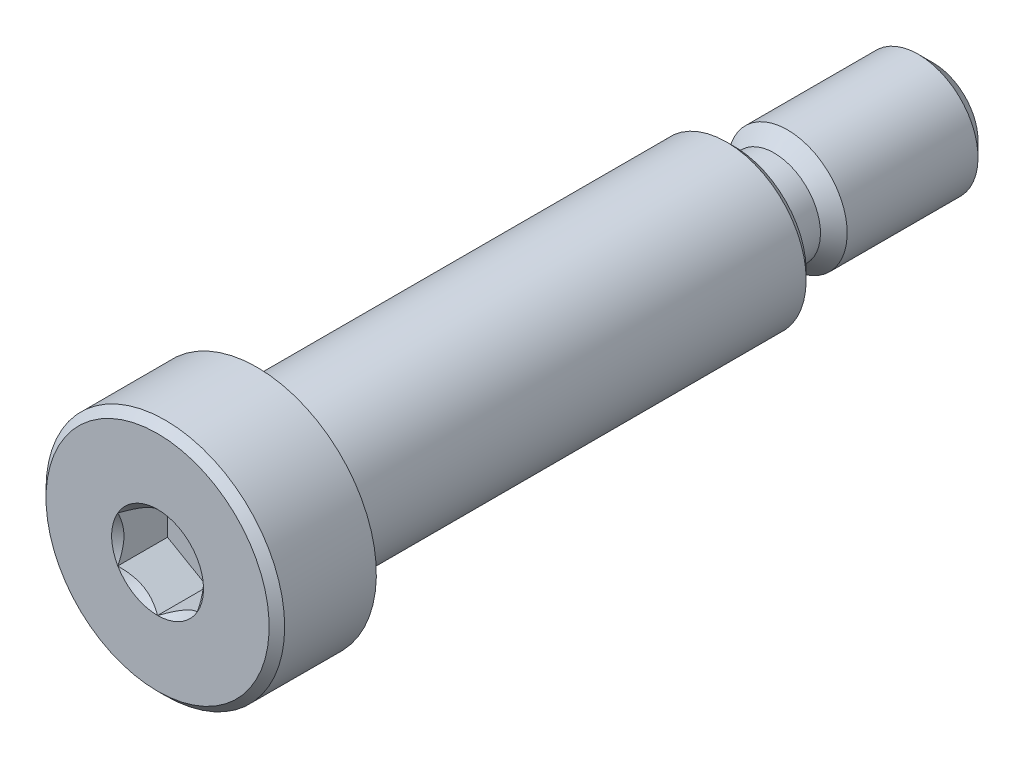
ISO-10303-21;
HEADER;
FILE_DESCRIPTION(('STEP AP214'),'2;1');
FILE_NAME('part.step','',(''),(''),'','','');
FILE_SCHEMA(('AUTOMOTIVE_DESIGN { 1 0 10303 214 1 1 1 1 }'));
ENDSEC;
DATA;
#1=APPLICATION_CONTEXT('core data for automotive mechanical design processes');
#2=APPLICATION_PROTOCOL_DEFINITION('international standard','automotive_design',2000,#1);
#3=PRODUCT_CONTEXT('',#1,'mechanical');
#4=PRODUCT('Part','Part','',(#3));
#5=PRODUCT_RELATED_PRODUCT_CATEGORY('part','',(#4));
#6=PRODUCT_DEFINITION_FORMATION('','',#4);
#7=PRODUCT_DEFINITION_CONTEXT('part definition',#1,'design');
#8=PRODUCT_DEFINITION('design','',#6,#7);
#9=PRODUCT_DEFINITION_SHAPE('','',#8);
#10=(LENGTH_UNIT() NAMED_UNIT(*) SI_UNIT(.MILLI.,.METRE.));
#11=(NAMED_UNIT(*) PLANE_ANGLE_UNIT() SI_UNIT($,.RADIAN.));
#12=(NAMED_UNIT(*) SI_UNIT($,.STERADIAN.) SOLID_ANGLE_UNIT());
#13=UNCERTAINTY_MEASURE_WITH_UNIT(LENGTH_MEASURE(1.E-05),#10,'distance_accuracy_value','');
#14=(GEOMETRIC_REPRESENTATION_CONTEXT(3) GLOBAL_UNCERTAINTY_ASSIGNED_CONTEXT((#13)) GLOBAL_UNIT_ASSIGNED_CONTEXT((#10,
#11,#12)) REPRESENTATION_CONTEXT('',''));
#15=CARTESIAN_POINT('',(0.,0.,0.));
#16=DIRECTION('',(0.,0.,1.));
#17=DIRECTION('',(1.,0.,0.));
#18=AXIS2_PLACEMENT_3D('',#15,#16,#17);
#19=CARTESIAN_POINT('',(0.,0.,0.));
#20=DIRECTION('',(0.,0.,1.));
#21=DIRECTION('',(0.,-1.,0.));
#22=AXIS2_PLACEMENT_3D('',#19,#20,#21);
#23=PLANE('',#22);
#24=CARTESIAN_POINT('',(0.,0.,0.));
#25=DIRECTION('',(0.,0.,1.));
#26=DIRECTION('',(1.,0.,0.));
#27=AXIS2_PLACEMENT_3D('',#24,#25,#26);
#28=CIRCLE('',#27,3.66617420935412);
#29=CARTESIAN_POINT('',(0.,-3.66617420935412,0.));
#30=VERTEX_POINT('',#29);
#31=CARTESIAN_POINT('',(3.175,-1.83308710467707,0.));
#32=VERTEX_POINT('',#31);
#33=EDGE_CURVE('E58',#30,#32,#28,.T.);
#34=ORIENTED_EDGE('',*,*,#33,.F.);
#35=CARTESIAN_POINT('',(-3.175,-1.83308710467706,0.));
#36=VERTEX_POINT('',#35);
#37=EDGE_CURVE('E65',#36,#30,#28,.T.);
#38=ORIENTED_EDGE('',*,*,#37,.F.);
#39=CARTESIAN_POINT('',(-3.175,1.83308710467706,0.));
#40=VERTEX_POINT('',#39);
#41=EDGE_CURVE('E138',#40,#36,#28,.T.);
#42=ORIENTED_EDGE('',*,*,#41,.F.);
#43=CARTESIAN_POINT('',(0.,3.66617420935412,0.));
#44=VERTEX_POINT('',#43);
#45=EDGE_CURVE('E133',#44,#40,#28,.T.);
#46=ORIENTED_EDGE('',*,*,#45,.F.);
#47=CARTESIAN_POINT('',(3.175,1.83308710467706,0.));
#48=VERTEX_POINT('',#47);
#49=EDGE_CURVE('E106',#48,#44,#28,.T.);
#50=ORIENTED_EDGE('',*,*,#49,.F.);
#51=EDGE_CURVE('E97',#32,#48,#28,.T.);
#52=ORIENTED_EDGE('',*,*,#51,.F.);
#53=EDGE_LOOP('',(#34,#38,#42,#46,#50,#52));
#54=FACE_BOUND('',#53,.T.);
#55=CARTESIAN_POINT('',(0.,0.,0.));
#56=DIRECTION('',(0.,0.,1.));
#57=DIRECTION('',(0.,-1.,0.));
#58=AXIS2_PLACEMENT_3D('',#55,#56,#57);
#59=CIRCLE('',#58,8.90587499999999);
#60=CARTESIAN_POINT('',(0.,-8.90587499999999,0.));
#61=VERTEX_POINT('',#60);
#62=EDGE_CURVE('E52',#61,#61,#59,.T.);
#63=ORIENTED_EDGE('',*,*,#62,.T.);
#64=EDGE_LOOP('',(#63));
#65=FACE_BOUND('',#64,.T.);
#66=ADVANCED_FACE('F38',(#54,#65),#23,.T.);
#67=CARTESIAN_POINT('',(0.,0.,-61.9125));
#68=DIRECTION('',(0.,0.,-1.));
#69=DIRECTION('',(0.,1.,0.));
#70=AXIS2_PLACEMENT_3D('',#67,#68,#69);
#71=CYLINDRICAL_SURFACE('',#70,9.525);
#72=CARTESIAN_POINT('',(0.,0.,-0.619125000000019));
#73=DIRECTION('',(0.,0.,1.));
#74=DIRECTION('',(0.,-1.,0.));
#75=AXIS2_PLACEMENT_3D('',#72,#73,#74);
#76=CIRCLE('',#75,9.525);
#77=CARTESIAN_POINT('',(0.,-9.525,-0.619125000000019));
#78=VERTEX_POINT('',#77);
#79=EDGE_CURVE('E230',#78,#78,#76,.F.);
#80=ORIENTED_EDGE('',*,*,#79,.T.);
#81=EDGE_LOOP('',(#80));
#82=FACE_BOUND('',#81,.T.);
#83=CARTESIAN_POINT('',(0.,0.,-7.93750000000001));
#84=DIRECTION('',(0.,0.,-1.));
#85=DIRECTION('',(0.,1.,0.));
#86=AXIS2_PLACEMENT_3D('',#83,#84,#85);
#87=CIRCLE('',#86,9.525);
#88=CARTESIAN_POINT('',(0.,9.525,-7.93750000000001));
#89=VERTEX_POINT('',#88);
#90=EDGE_CURVE('E245',#89,#89,#87,.T.);
#91=ORIENTED_EDGE('',*,*,#90,.F.);
#92=EDGE_LOOP('',(#91));
#93=FACE_BOUND('',#92,.T.);
#94=ADVANCED_FACE('F199',(#82,#93),#71,.T.);
#95=CARTESIAN_POINT('',(0.,-9.525,-7.93750000000001));
#96=DIRECTION('',(0.,0.,-1.));
#97=DIRECTION('',(0.,1.,0.));
#98=AXIS2_PLACEMENT_3D('',#95,#96,#97);
#99=PLANE('',#98);
#100=ORIENTED_EDGE('',*,*,#90,.T.);
#101=EDGE_LOOP('',(#100));
#102=FACE_BOUND('',#101,.T.);
#103=CARTESIAN_POINT('',(0.,0.,-7.93750000000001));
#104=DIRECTION('',(0.,0.,-1.));
#105=DIRECTION('',(0.,1.,0.));
#106=AXIS2_PLACEMENT_3D('',#103,#104,#105);
#107=CIRCLE('',#106,6.34999999999999);
#108=CARTESIAN_POINT('',(0.,6.34999999999999,-7.93750000000001));
#109=VERTEX_POINT('',#108);
#110=EDGE_CURVE('E247',#109,#109,#107,.T.);
#111=ORIENTED_EDGE('',*,*,#110,.F.);
#112=EDGE_LOOP('',(#111));
#113=FACE_BOUND('',#112,.T.);
#114=ADVANCED_FACE('F204',(#102,#113),#99,.T.);
#115=CARTESIAN_POINT('',(0.,0.,-61.9125));
#116=DIRECTION('',(0.,0.,-1.));
#117=DIRECTION('',(0.,1.,0.));
#118=AXIS2_PLACEMENT_3D('',#115,#116,#117);
#119=CYLINDRICAL_SURFACE('',#118,6.35);
#120=CARTESIAN_POINT('',(0.,0.,-45.418375));
#121=DIRECTION('',(0.,0.,-1.));
#122=DIRECTION('',(0.,1.,0.));
#123=AXIS2_PLACEMENT_3D('',#120,#121,#122);
#124=CIRCLE('',#123,6.35);
#125=CARTESIAN_POINT('',(0.,-6.34999999999999,-45.418375));
#126=VERTEX_POINT('',#125);
#127=EDGE_CURVE('E223',#126,#126,#124,.F.);
#128=ORIENTED_EDGE('',*,*,#127,.T.);
#129=EDGE_LOOP('',(#128));
#130=FACE_BOUND('',#129,.T.);
#131=ORIENTED_EDGE('',*,*,#110,.T.);
#132=EDGE_LOOP('',(#131));
#133=FACE_BOUND('',#132,.T.);
#134=ADVANCED_FACE('F348',(#130,#133),#119,.T.);
#135=CARTESIAN_POINT('',(0.,-6.35,-46.0375));
#136=DIRECTION('',(0.,0.,-1.));
#137=DIRECTION('',(0.,1.,0.));
#138=AXIS2_PLACEMENT_3D('',#135,#136,#137);
#139=PLANE('',#138);
#140=CARTESIAN_POINT('',(0.,0.,-46.0375));
#141=DIRECTION('',(0.,0.,-1.));
#142=DIRECTION('',(0.,1.,0.));
#143=AXIS2_PLACEMENT_3D('',#140,#141,#142);
#144=CIRCLE('',#143,5.73087499999999);
#145=CARTESIAN_POINT('',(0.,-5.73087499999998,-46.0375));
#146=VERTEX_POINT('',#145);
#147=EDGE_CURVE('E226',#146,#146,#144,.T.);
#148=ORIENTED_EDGE('',*,*,#147,.T.);
#149=EDGE_LOOP('',(#148));
#150=FACE_BOUND('',#149,.T.);
#151=CARTESIAN_POINT('',(0.,0.,-46.0375));
#152=DIRECTION('',(0.,0.,-1.));
#153=DIRECTION('',(0.,1.,0.));
#154=AXIS2_PLACEMENT_3D('',#151,#152,#153);
#155=CIRCLE('',#154,4.7625);
#156=CARTESIAN_POINT('',(0.,4.7625,-46.0375));
#157=VERTEX_POINT('',#156);
#158=EDGE_CURVE('E256',#157,#157,#155,.T.);
#159=ORIENTED_EDGE('',*,*,#158,.F.);
#160=EDGE_LOOP('',(#159));
#161=FACE_BOUND('',#160,.T.);
#162=ADVANCED_FACE('F355',(#150,#161),#139,.T.);
#163=CARTESIAN_POINT('',(0.,0.,-47.1043));
#164=DIRECTION('',(0.,0.,-1.));
#165=DIRECTION('',(0.,1.,0.));
#166=AXIS2_PLACEMENT_3D('',#163,#164,#165);
#167=TOROIDAL_SURFACE('',#166,4.7625,1.0668);
#168=CARTESIAN_POINT('',(0.,0.,-47.1043));
#169=DIRECTION('',(0.,0.,-1.));
#170=DIRECTION('',(0.,1.,0.));
#171=AXIS2_PLACEMENT_3D('',#168,#169,#170);
#172=CIRCLE('',#171,3.6957);
#173=CARTESIAN_POINT('',(0.,3.6957,-47.1043));
#174=VERTEX_POINT('',#173);
#175=EDGE_CURVE('E260',#174,#174,#172,.T.);
#176=ORIENTED_EDGE('',*,*,#175,.F.);
#177=EDGE_LOOP('',(#176));
#178=FACE_BOUND('',#177,.T.);
#179=ORIENTED_EDGE('',*,*,#158,.T.);
#180=EDGE_LOOP('',(#179));
#181=FACE_BOUND('',#180,.T.);
#182=ADVANCED_FACE('F363',(#178,#181),#167,.F.);
#183=CARTESIAN_POINT('',(0.,0.,-61.9125));
#184=DIRECTION('',(0.,0.,-1.));
#185=DIRECTION('',(0.,1.,0.));
#186=AXIS2_PLACEMENT_3D('',#183,#184,#185);
#187=CYLINDRICAL_SURFACE('',#186,3.6957);
#188=CARTESIAN_POINT('',(0.,0.,-49.2125));
#189=DIRECTION('',(0.,0.,-1.));
#190=DIRECTION('',(0.,1.,0.));
#191=AXIS2_PLACEMENT_3D('',#188,#189,#190);
#192=CIRCLE('',#191,3.6957);
#193=CARTESIAN_POINT('',(0.,3.6957,-49.2125));
#194=VERTEX_POINT('',#193);
#195=EDGE_CURVE('E264',#194,#194,#192,.T.);
#196=ORIENTED_EDGE('',*,*,#195,.F.);
#197=EDGE_LOOP('',(#196));
#198=FACE_BOUND('',#197,.T.);
#199=ORIENTED_EDGE('',*,*,#175,.T.);
#200=EDGE_LOOP('',(#199));
#201=FACE_BOUND('',#200,.T.);
#202=ADVANCED_FACE('F389',(#198,#201),#187,.T.);
#203=CARTESIAN_POINT('',(0.,0.,-49.2125));
#204=DIRECTION('',(0.,0.,-1.));
#205=DIRECTION('',(0.,1.,0.));
#206=AXIS2_PLACEMENT_3D('',#203,#204,#205);
#207=CONICAL_SURFACE('',#206,3.6957,0.785398163397443);
#208=CARTESIAN_POINT('',(0.,0.,-50.2793));
#209=DIRECTION('',(0.,0.,-1.));
#210=DIRECTION('',(0.,1.,0.));
#211=AXIS2_PLACEMENT_3D('',#208,#209,#210);
#212=CIRCLE('',#211,4.7625);
#213=CARTESIAN_POINT('',(0.,4.7625,-50.2793));
#214=VERTEX_POINT('',#213);
#215=EDGE_CURVE('E251',#214,#214,#212,.F.);
#216=ORIENTED_EDGE('',*,*,#215,.T.);
#217=EDGE_LOOP('',(#216));
#218=FACE_BOUND('',#217,.T.);
#219=ORIENTED_EDGE('',*,*,#195,.T.);
#220=EDGE_LOOP('',(#219));
#221=FACE_BOUND('',#220,.T.);
#222=ADVANCED_FACE('F380',(#218,#221),#207,.T.);
#223=CARTESIAN_POINT('',(0.,-4.7625,-61.9125));
#224=DIRECTION('',(0.,0.,-1.));
#225=DIRECTION('',(0.,1.,0.));
#226=AXIS2_PLACEMENT_3D('',#223,#224,#225);
#227=PLANE('',#226);
#228=CARTESIAN_POINT('',(0.,0.,-61.9125));
#229=DIRECTION('',(0.,0.,-1.));
#230=DIRECTION('',(0.,1.,0.));
#231=AXIS2_PLACEMENT_3D('',#228,#229,#230);
#232=CIRCLE('',#231,3.57187500000002);
#233=CARTESIAN_POINT('',(0.,3.57187500000002,-61.9125));
#234=VERTEX_POINT('',#233);
#235=EDGE_CURVE('E233',#234,#234,#232,.T.);
#236=ORIENTED_EDGE('',*,*,#235,.T.);
#237=EDGE_LOOP('',(#236));
#238=FACE_BOUND('',#237,.T.);
#239=ADVANCED_FACE('F371',(#238),#227,.T.);
#240=CARTESIAN_POINT('',(0.,0.,-61.9125));
#241=DIRECTION('',(0.,0.,-1.));
#242=DIRECTION('',(0.,1.,0.));
#243=AXIS2_PLACEMENT_3D('',#240,#241,#242);
#244=CYLINDRICAL_SURFACE('',#243,4.7625);
#245=CARTESIAN_POINT('',(0.,0.,-60.721875));
#246=DIRECTION('',(0.,0.,-1.));
#247=DIRECTION('',(0.,1.,0.));
#248=AXIS2_PLACEMENT_3D('',#245,#246,#247);
#249=CIRCLE('',#248,4.7625);
#250=CARTESIAN_POINT('',(0.,4.7625,-60.721875));
#251=VERTEX_POINT('',#250);
#252=EDGE_CURVE('E228',#251,#251,#249,.F.);
#253=ORIENTED_EDGE('',*,*,#252,.T.);
#254=EDGE_LOOP('',(#253));
#255=FACE_BOUND('',#254,.T.);
#256=ORIENTED_EDGE('',*,*,#215,.F.);
#257=EDGE_LOOP('',(#256));
#258=FACE_BOUND('',#257,.T.);
#259=ADVANCED_FACE('F212',(#255,#258),#244,.T.);
#260=CARTESIAN_POINT('',(0.,0.,-61.9125));
#261=DIRECTION('',(0.,0.,1.));
#262=DIRECTION('',(0.,-1.,0.));
#263=AXIS2_PLACEMENT_3D('',#260,#261,#262);
#264=CONICAL_SURFACE('',#263,3.57187500000002,0.785398163397442);
#265=ORIENTED_EDGE('',*,*,#252,.F.);
#266=EDGE_LOOP('',(#265));
#267=FACE_BOUND('',#266,.T.);
#268=ORIENTED_EDGE('',*,*,#235,.F.);
#269=EDGE_LOOP('',(#268));
#270=FACE_BOUND('',#269,.T.);
#271=ADVANCED_FACE('F209',(#267,#270),#264,.T.);
#272=CARTESIAN_POINT('',(0.,0.,-46.0375));
#273=DIRECTION('',(0.,0.,1.));
#274=DIRECTION('',(0.,-1.,0.));
#275=AXIS2_PLACEMENT_3D('',#272,#273,#274);
#276=CONICAL_SURFACE('',#275,5.73087499999999,0.78539816339745);
#277=CARTESIAN_POINT('',(0.,-6.34999999999999,-45.418375));
#278=CARTESIAN_POINT('',(0.,-6.34355078124999,-45.42482421875));
#279=CARTESIAN_POINT('',(0.,-6.33710156249999,-45.4312734375));
#280=CARTESIAN_POINT('',(0.,-6.32420312499999,-45.444171875));
#281=CARTESIAN_POINT('',(0.,-6.31775390624999,-45.45062109375));
#282=CARTESIAN_POINT('',(0.,-6.30485546874999,-45.46351953125));
#283=CARTESIAN_POINT('',(0.,-6.29840624999999,-45.46996875));
#284=CARTESIAN_POINT('',(0.,-6.28550781249999,-45.4828671875));
#285=CARTESIAN_POINT('',(0.,-6.27905859374999,-45.48931640625));
#286=CARTESIAN_POINT('',(0.,-6.26616015624999,-45.50221484375));
#287=CARTESIAN_POINT('',(0.,-6.25971093749999,-45.5086640625));
#288=CARTESIAN_POINT('',(0.,-6.24681249999999,-45.5215625));
#289=CARTESIAN_POINT('',(0.,-6.24036328124999,-45.52801171875));
#290=CARTESIAN_POINT('',(0.,-6.22746484374999,-45.54091015625));
#291=CARTESIAN_POINT('',(0.,-6.22101562499999,-45.547359375));
#292=CARTESIAN_POINT('',(0.,-6.20811718749999,-45.5602578125));
#293=CARTESIAN_POINT('',(0.,-6.20166796874999,-45.56670703125));
#294=CARTESIAN_POINT('',(0.,-6.18876953124999,-45.57960546875));
#295=CARTESIAN_POINT('',(0.,-6.18232031249999,-45.5860546875));
#296=CARTESIAN_POINT('',(0.,-6.16942187499999,-45.598953125));
#297=CARTESIAN_POINT('',(0.,-6.16297265624999,-45.60540234375));
#298=CARTESIAN_POINT('',(0.,-6.15007421874999,-45.61830078125));
#299=CARTESIAN_POINT('',(0.,-6.14362499999999,-45.62475));
#300=CARTESIAN_POINT('',(0.,-6.13072656249999,-45.6376484375));
#301=CARTESIAN_POINT('',(0.,-6.12427734374999,-45.64409765625));
#302=CARTESIAN_POINT('',(0.,-6.11137890624999,-45.65699609375));
#303=CARTESIAN_POINT('',(0.,-6.10492968749999,-45.6634453125));
#304=CARTESIAN_POINT('',(0.,-6.09203124999999,-45.67634375));
#305=CARTESIAN_POINT('',(0.,-6.08558203124999,-45.68279296875));
#306=CARTESIAN_POINT('',(0.,-6.07268359374999,-45.69569140625));
#307=CARTESIAN_POINT('',(0.,-6.06623437499999,-45.702140625));
#308=CARTESIAN_POINT('',(0.,-6.05333593749999,-45.7150390625));
#309=CARTESIAN_POINT('',(0.,-6.04688671874999,-45.72148828125));
#310=CARTESIAN_POINT('',(0.,-6.03398828124999,-45.73438671875));
#311=CARTESIAN_POINT('',(0.,-6.02753906249999,-45.7408359375));
#312=CARTESIAN_POINT('',(0.,-6.01464062499999,-45.753734375));
#313=CARTESIAN_POINT('',(0.,-6.00819140624999,-45.76018359375));
#314=CARTESIAN_POINT('',(0.,-5.99529296874999,-45.77308203125));
#315=CARTESIAN_POINT('',(0.,-5.98884374999998,-45.77953125));
#316=CARTESIAN_POINT('',(0.,-5.97594531249998,-45.7924296875));
#317=CARTESIAN_POINT('',(0.,-5.96949609374999,-45.79887890625));
#318=CARTESIAN_POINT('',(0.,-5.95659765624999,-45.81177734375));
#319=CARTESIAN_POINT('',(0.,-5.95014843749999,-45.8182265625));
#320=CARTESIAN_POINT('',(0.,-5.93724999999999,-45.831125));
#321=CARTESIAN_POINT('',(0.,-5.93080078124999,-45.83757421875));
#322=CARTESIAN_POINT('',(0.,-5.91790234374998,-45.85047265625));
#323=CARTESIAN_POINT('',(0.,-5.91145312499998,-45.856921875));
#324=CARTESIAN_POINT('',(0.,-5.89855468749998,-45.8698203125));
#325=CARTESIAN_POINT('',(0.,-5.89210546874998,-45.87626953125));
#326=CARTESIAN_POINT('',(0.,-5.87920703124998,-45.88916796875));
#327=CARTESIAN_POINT('',(0.,-5.87275781249998,-45.8956171875));
#328=CARTESIAN_POINT('',(0.,-5.85985937499998,-45.908515625));
#329=CARTESIAN_POINT('',(0.,-5.85341015624998,-45.91496484375));
#330=CARTESIAN_POINT('',(0.,-5.84051171874998,-45.92786328125));
#331=CARTESIAN_POINT('',(0.,-5.83406249999998,-45.9343125));
#332=CARTESIAN_POINT('',(0.,-5.82116406249998,-45.9472109375));
#333=CARTESIAN_POINT('',(0.,-5.81471484374998,-45.95366015625));
#334=CARTESIAN_POINT('',(0.,-5.80181640624998,-45.96655859375));
#335=CARTESIAN_POINT('',(0.,-5.79536718749998,-45.9730078125));
#336=CARTESIAN_POINT('',(0.,-5.78246874999998,-45.98590625));
#337=CARTESIAN_POINT('',(0.,-5.77601953124998,-45.99235546875));
#338=CARTESIAN_POINT('',(0.,-5.76312109374998,-46.00525390625));
#339=CARTESIAN_POINT('',(0.,-5.75667187499998,-46.011703125));
#340=CARTESIAN_POINT('',(0.,-5.74377343749998,-46.0246015625));
#341=CARTESIAN_POINT('',(0.,-5.73732421874998,-46.03105078125));
#342=CARTESIAN_POINT('',(0.,-5.73087499999998,-46.0375));
#343=B_SPLINE_CURVE_WITH_KNOTS('',3,(#277,#278,#279,#280,#281,#282,#283,#284,#285,#286,#287,
#288,#289,#290,#291,#292,#293,#294,#295,#296,#297,#298,#299,#300,#301,#302,#303,#304,#305,#306,
#307,#308,#309,#310,#311,#312,#313,#314,#315,#316,#317,#318,#319,#320,#321,#322,#323,#324,#325,
#326,#327,#328,#329,#330,#331,#332,#333,#334,#335,#336,#337,#338,#339,#340,#341,#342),
.UNSPECIFIED.,.F.,.F.,(4,2,2,2,2,2,2,2,2,2,2,2,2,2,2,2,2,2,2,2,2,2,2,2,2,2,2,2,2,2,2,2,4),(0.,
0.0273617178688837,0.0547234357377674,0.0820851536066518,0.109446871475536,0.136808589344414,
0.164170307213299,0.191532025082182,0.218893742951066,0.24625546081995,0.273617178688829,
0.300978896557713,0.328340614426597,0.355702332295481,0.38306405016436,0.410425768033244,
0.437787485902128,0.465149203771012,0.492510921639895,0.519872639508775,0.547234357377659,
0.574596075246542,0.601957793115427,0.629319510984305,0.656681228853189,0.684042946722074,
0.711404664590957,0.738766382459841,0.76612810032872,0.793489818197604,0.820851536066488,
0.848213253935372,0.875574971804251),.UNSPECIFIED.);
#344=EDGE_CURVE('BSEAM211',#126,#146,#343,.T.);
#345=ORIENTED_EDGE('',*,*,#127,.F.);
#346=ORIENTED_EDGE('',*,*,#147,.F.);
#347=ORIENTED_EDGE('',*,*,#344,.T.);
#348=ORIENTED_EDGE('',*,*,#344,.F.);
#349=EDGE_LOOP('',(#345,#347,#346,#348));
#350=FACE_BOUND('',#349,.T.);
#351=ADVANCED_FACE('F211',(#350),#276,.T.);
#352=CARTESIAN_POINT('',(0.,0.,-0.619125000000019));
#353=DIRECTION('',(0.,0.,-1.));
#354=DIRECTION('',(0.,1.,0.));
#355=AXIS2_PLACEMENT_3D('',#352,#353,#354);
#356=CONICAL_SURFACE('',#355,9.525,0.785398163397443);
#357=ORIENTED_EDGE('',*,*,#62,.F.);
#358=EDGE_LOOP('',(#357));
#359=FACE_BOUND('',#358,.T.);
#360=ORIENTED_EDGE('',*,*,#79,.F.);
#361=EDGE_LOOP('',(#360));
#362=FACE_BOUND('',#361,.T.);
#363=ADVANCED_FACE('F40',(#359,#362),#356,.T.);
#364=CARTESIAN_POINT('',(0.,0.,0.));
#365=DIRECTION('',(0.,0.,1.));
#366=DIRECTION('',(1.,0.,0.));
#367=AXIS2_PLACEMENT_3D('',#364,#365,#366);
#368=CONICAL_SURFACE('',#367,3.66617420935412,0.78539816339745);
#369=ORIENTED_EDGE('',*,*,#49,.T.);
#370=CARTESIAN_POINT('',(3.1752,1.83297163462322,0.000115475508944067));
#371=CARTESIAN_POINT('',(3.06606165005017,1.89598269034567,-0.0628410163082169));
#372=CARTESIAN_POINT('',(2.95509837192206,1.9600473688431,-0.122099895765255));
#373=CARTESIAN_POINT('',(2.72883215365405,2.09068223086865,-0.230601344269443));
#374=CARTESIAN_POINT('',(2.61350769674774,2.15726483710766,-0.279783546061288));
#375=CARTESIAN_POINT('',(2.38096147751938,2.29152545937818,-0.364033541125997));
#376=CARTESIAN_POINT('',(2.26379893371885,2.35916928558036,-0.399313085500551));
#377=CARTESIAN_POINT('',(2.02689455535372,2.49594609220167,-0.45366842986518));
#378=CARTESIAN_POINT('',(1.90715995735645,2.5650748945867,-0.47278480247036));
#379=CARTESIAN_POINT('',(1.70080208124842,2.68421566990707,-0.490032869376752));
#380=CARTESIAN_POINT('',(1.61444529227085,2.73407378526963,-0.492586066386179));
#381=CARTESIAN_POINT('',(1.44187218347529,2.83370891608763,-0.488283726876735));
#382=CARTESIAN_POINT('',(1.3556559235072,2.88348589698873,-0.481424891978556));
#383=CARTESIAN_POINT('',(1.18404020841287,2.98256827629561,-0.4586901166963));
#384=CARTESIAN_POINT('',(1.09864177574673,3.03187308438378,-0.442804090312722));
#385=CARTESIAN_POINT('',(0.929311596694528,3.1296359088415,-0.402882016002049));
#386=CARTESIAN_POINT('',(0.845379738380253,3.17809398983283,-0.37884659291483));
#387=CARTESIAN_POINT('',(0.696376420715886,3.2641210953965,-0.329394765582835));
#388=CARTESIAN_POINT('',(0.630975148808269,3.30188053733771,-0.305278280699013));
#389=CARTESIAN_POINT('',(0.501346749794894,3.3767215284027,-0.253158532862845));
#390=CARTESIAN_POINT('',(0.437119658558277,3.41380305681743,-0.225155151396475));
#391=CARTESIAN_POINT('',(0.3100419654874,3.48717139711989,-0.165889434455491));
#392=CARTESIAN_POINT('',(0.247187749251276,3.52346029578352,-0.134637346645791));
#393=CARTESIAN_POINT('',(0.122643379151907,3.59536602138644,-0.0692846556080675));
#394=CARTESIAN_POINT('',(0.0609525390212909,3.63098324454239,-0.0351858004814551));
#395=CARTESIAN_POINT('',(-0.000199999999999575,3.66628967940796,0.000115475508943787));
#396=B_SPLINE_CURVE_WITH_KNOTS('',3,(#370,#371,#372,#373,#374,#375,#376,#377,#378,#379,#380,
#381,#382,#383,#384,#385,#386,#387,#388,#389,#390,#391,#392,#393,#394,#395),.UNSPECIFIED.,.F.,
.F.,(4,2,2,2,2,2,2,2,2,2,2,2,4),(0.,0.422910572436808,0.848285055427807,1.26690402276127,
1.68446903107506,1.98329272958351,2.2822211754689,2.58148426995465,2.88072442418452,
3.11844134429546,3.35616551414405,3.59316134346767,3.8300126974443),.UNSPECIFIED.);
#397=EDGE_CURVE('E11',#48,#44,#396,.T.);
#398=ORIENTED_EDGE('',*,*,#397,.F.);
#399=EDGE_LOOP('',(#369,#398));
#400=FACE_BOUND('',#399,.T.);
#401=ADVANCED_FACE('F109',(#400),#368,.F.);
#402=ORIENTED_EDGE('',*,*,#45,.T.);
#403=CARTESIAN_POINT('',(0.000200000000000467,3.66628967940796,0.000115475508943935));
#404=CARTESIAN_POINT('',(-0.108938349949825,3.60327862368552,-0.0628410163082174));
#405=CARTESIAN_POINT('',(-0.219901628077944,3.53921394518809,-0.122099895765256));
#406=CARTESIAN_POINT('',(-0.446167846345946,3.40857908316254,-0.230601344269443));
#407=CARTESIAN_POINT('',(-0.561492303252261,3.34199647692353,-0.279783546061287));
#408=CARTESIAN_POINT('',(-0.794038522480624,3.207735854653,-0.364033541125996));
#409=CARTESIAN_POINT('',(-0.911201066281148,3.14009202845083,-0.39931308550055));
#410=CARTESIAN_POINT('',(-1.14810544464628,3.00331522182952,-0.453668429865179));
#411=CARTESIAN_POINT('',(-1.26784004264355,2.93418641944448,-0.47278480247036));
#412=CARTESIAN_POINT('',(-1.47419791875158,2.81504564412411,-0.490032869376752));
#413=CARTESIAN_POINT('',(-1.56055470772915,2.76518752876156,-0.492586066386179));
#414=CARTESIAN_POINT('',(-1.73312781652471,2.66555239794355,-0.488283726876735));
#415=CARTESIAN_POINT('',(-1.8193440764928,2.61577541704245,-0.481424891978555));
#416=CARTESIAN_POINT('',(-1.99095979158713,2.51669303773558,-0.458690116696299));
#417=CARTESIAN_POINT('',(-2.07635822425327,2.4673882296474,-0.442804090312722));
#418=CARTESIAN_POINT('',(-2.24568840330547,2.36962540518969,-0.402882016002048));
#419=CARTESIAN_POINT('',(-2.32962026161975,2.32116732419836,-0.37884659291483));
#420=CARTESIAN_POINT('',(-2.47862357928411,2.23514021863469,-0.329394765582835));
#421=CARTESIAN_POINT('',(-2.54402485119173,2.19738077669348,-0.305278280699012));
#422=CARTESIAN_POINT('',(-2.67365325020511,2.12253978562849,-0.253158532862845));
#423=CARTESIAN_POINT('',(-2.73788034144172,2.08545825721376,-0.225155151396475));
#424=CARTESIAN_POINT('',(-2.8649580345126,2.01208991691129,-0.165889434455491));
#425=CARTESIAN_POINT('',(-2.92781225074872,1.97580101824767,-0.134637346645791));
#426=CARTESIAN_POINT('',(-3.05235662084809,1.90389529264474,-0.0692846556080678));
#427=CARTESIAN_POINT('',(-3.11404746097871,1.8682780694888,-0.0351858004814554));
#428=CARTESIAN_POINT('',(-3.1752,1.83297163462323,0.000115475508943606));
#429=B_SPLINE_CURVE_WITH_KNOTS('',3,(#403,#404,#405,#406,#407,#408,#409,#410,#411,#412,#413,
#414,#415,#416,#417,#418,#419,#420,#421,#422,#423,#424,#425,#426,#427,#428),.UNSPECIFIED.,.F.,
.F.,(4,2,2,2,2,2,2,2,2,2,2,2,4),(0.,0.422910572436808,0.848285055427807,1.26690402276127,
1.68446903107506,1.98329272958351,2.2822211754689,2.58148426995465,2.88072442418451,
3.11844134429546,3.35616551414405,3.59316134346766,3.8300126974443),.UNSPECIFIED.);
#430=EDGE_CURVE('E134',#44,#40,#429,.T.);
#431=ORIENTED_EDGE('',*,*,#430,.F.);
#432=EDGE_LOOP('',(#402,#431));
#433=FACE_BOUND('',#432,.T.);
#434=ADVANCED_FACE('F301',(#433),#368,.F.);
#435=ORIENTED_EDGE('',*,*,#41,.T.);
#436=CARTESIAN_POINT('',(-3.175,-3.65592387452516,1.17597452610651));
#437=CARTESIAN_POINT('',(-3.175,-3.56690614739902,1.10877955728795));
#438=CARTESIAN_POINT('',(-3.175,-3.47739001482927,1.04223411677949));
#439=CARTESIAN_POINT('',(-3.175,-3.29716433407819,0.910733107989));
#440=CARTESIAN_POINT('',(-3.175,-3.20645449195236,0.8457779430093));
#441=CARTESIAN_POINT('',(-3.175,-3.02298124672425,0.717286472588262));
#442=CARTESIAN_POINT('',(-3.175,-2.93020737789476,0.653765060519482));
#443=CARTESIAN_POINT('',(-3.175,-2.74308490461527,0.529093231239513));
#444=CARTESIAN_POINT('',(-3.175,-2.64873641209623,0.467942646518007));
#445=CARTESIAN_POINT('',(-3.175,-2.45276910629102,0.345127291468585));
#446=CARTESIAN_POINT('',(-3.175,-2.35104296923552,0.283632900035067));
#447=CARTESIAN_POINT('',(-3.175,-2.14521620329061,0.164690024110211));
#448=CARTESIAN_POINT('',(-3.175,-2.04111520164361,0.107242180628362));
#449=CARTESIAN_POINT('',(-3.175,-1.8305483898592,-0.00236807378855735));
#450=CARTESIAN_POINT('',(-3.175,-1.72409073387149,-0.05454602658689));
#451=CARTESIAN_POINT('',(-3.175,-1.50827203793058,-0.152448430174923));
#452=CARTESIAN_POINT('',(-3.175,-1.39891233941784,-0.198175803007057));
#453=CARTESIAN_POINT('',(-3.175,-1.18604701054559,-0.278193824629251));
#454=CARTESIAN_POINT('',(-3.175,-1.08277848917347,-0.313108695034414));
#455=CARTESIAN_POINT('',(-3.175,-0.873755153890324,-0.374653665073786));
#456=CARTESIAN_POINT('',(-3.175,-0.768000169236097,-0.401283193963396));
#457=CARTESIAN_POINT('',(-3.175,-0.556394353071963,-0.444423804951883));
#458=CARTESIAN_POINT('',(-3.175,-0.450579451492892,-0.461108250420231));
#459=CARTESIAN_POINT('',(-3.175,-0.237818454981045,-0.484034858218018));
#460=CARTESIAN_POINT('',(-3.175,-0.130872557680108,-0.49027881555587));
#461=CARTESIAN_POINT('',(-3.175,0.0792250150830045,-0.491860727197653));
#462=CARTESIAN_POINT('',(-3.175,0.18237391199382,-0.487585251998013));
#463=CARTESIAN_POINT('',(-3.175,0.387788153537299,-0.469217325011947));
#464=CARTESIAN_POINT('',(-3.175,0.490053411359905,-0.455123919552885));
#465=CARTESIAN_POINT('',(-3.175,0.694689208906974,-0.417649304806497));
#466=CARTESIAN_POINT('',(-3.175,0.797030337701614,-0.394110040645698));
#467=CARTESIAN_POINT('',(-3.175,0.999482692253839,-0.3389990990408));
#468=CARTESIAN_POINT('',(-3.175,1.09959410383402,-0.307428093699382));
#469=CARTESIAN_POINT('',(-3.175,1.30666025401972,-0.234302973381313));
#470=CARTESIAN_POINT('',(-3.175,1.41338058113121,-0.192091761298271));
#471=CARTESIAN_POINT('',(-3.175,1.62403512608011,-0.101194633675295));
#472=CARTESIAN_POINT('',(-3.175,1.72796839622315,-0.0525065484982067));
#473=CARTESIAN_POINT('',(-3.175,1.93357808805447,0.0501937756761229));
#474=CARTESIAN_POINT('',(-3.175,2.03524592560239,0.104223062169345));
#475=CARTESIAN_POINT('',(-3.175,2.23624195707291,0.216408901364748));
#476=CARTESIAN_POINT('',(-3.175,2.3355705197654,0.274564797656881));
#477=CARTESIAN_POINT('',(-3.175,2.52730642275902,0.391215115503931));
#478=CARTESIAN_POINT('',(-3.175,2.61981218330511,0.449548619193316));
#479=CARTESIAN_POINT('',(-3.175,2.80323560367684,0.568668649469825));
#480=CARTESIAN_POINT('',(-3.175,2.89415314246283,0.629455361859399));
#481=CARTESIAN_POINT('',(-3.175,3.07387072487129,0.752541216482857));
#482=CARTESIAN_POINT('',(-3.175,3.16268196996071,0.814824062049374));
#483=CARTESIAN_POINT('',(-3.175,3.33909075370388,0.941036832486232));
#484=CARTESIAN_POINT('',(-3.175,3.42668861940902,1.00496629970184));
#485=CARTESIAN_POINT('',(-3.175,3.51377838474595,1.06956897805668));
#486=B_SPLINE_CURVE_WITH_KNOTS('',3,(#436,#437,#438,#439,#440,#441,#442,#443,#444,#445,#446,
#447,#448,#449,#450,#451,#452,#453,#454,#455,#456,#457,#458,#459,#460,#461,#462,#463,#464,#465,
#466,#467,#468,#469,#470,#471,#472,#473,#474,#475,#476,#477,#478,#479,#480,#481,#482,#483,#484,
#485),.UNSPECIFIED.,.F.,.F.,(4,2,2,2,2,2,2,2,2,2,2,2,2,2,2,2,2,2,2,2,2,2,2,2,4),(0.,
0.334601712013315,0.669287419770511,1.00656636796479,1.3438214421939,1.70035269072413,
2.05694029057745,2.41244349871029,2.76778514705124,3.09453137075717,3.42130009774479,
3.74219200698696,4.06302874036785,4.37225254917033,4.68150639886781,4.99616636831742,
5.31080001541914,5.65482708645254,5.99896969199844,6.34424851858142,6.68947254507109,
7.01751396994993,7.34558028700741,7.67098168170701,7.99629359145139),.UNSPECIFIED.);
#487=EDGE_CURVE('E136',#40,#36,#486,.F.);
#488=ORIENTED_EDGE('',*,*,#487,.F.);
#489=EDGE_LOOP('',(#435,#488));
#490=FACE_BOUND('',#489,.T.);
#491=ADVANCED_FACE('F298',(#490),#368,.F.);
#492=ORIENTED_EDGE('',*,*,#37,.T.);
#493=CARTESIAN_POINT('',(-3.1752,-1.83297163462322,0.000115475508942766));
#494=CARTESIAN_POINT('',(-3.06606165005017,-1.89598269034567,-0.0628410163082177));
#495=CARTESIAN_POINT('',(-2.95509837192205,-1.9600473688431,-0.122099895765256));
#496=CARTESIAN_POINT('',(-2.72883215365405,-2.09068223086865,-0.230601344269444));
#497=CARTESIAN_POINT('',(-2.61350769674774,-2.15726483710766,-0.279783546061288));
#498=CARTESIAN_POINT('',(-2.38096147751938,-2.29152545937818,-0.364033541125997));
#499=CARTESIAN_POINT('',(-2.26379893371885,-2.35916928558036,-0.39931308550055));
#500=CARTESIAN_POINT('',(-2.02689455535372,-2.49594609220167,-0.453668429865179));
#501=CARTESIAN_POINT('',(-1.90715995735645,-2.5650748945867,-0.47278480247036));
#502=CARTESIAN_POINT('',(-1.70080208124842,-2.68421566990707,-0.490032869376752));
#503=CARTESIAN_POINT('',(-1.61444529227085,-2.73407378526963,-0.492586066386179));
#504=CARTESIAN_POINT('',(-1.44187218347529,-2.83370891608763,-0.488283726876735));
#505=CARTESIAN_POINT('',(-1.3556559235072,-2.88348589698873,-0.481424891978556));
#506=CARTESIAN_POINT('',(-1.18404020841287,-2.98256827629561,-0.4586901166963));
#507=CARTESIAN_POINT('',(-1.09864177574673,-3.03187308438378,-0.442804090312722));
#508=CARTESIAN_POINT('',(-0.929311596694529,-3.1296359088415,-0.402882016002049));
#509=CARTESIAN_POINT('',(-0.845379738380255,-3.17809398983283,-0.37884659291483));
#510=CARTESIAN_POINT('',(-0.696376420715887,-3.2641210953965,-0.329394765582836));
#511=CARTESIAN_POINT('',(-0.63097514880827,-3.3018805373377,-0.305278280699013));
#512=CARTESIAN_POINT('',(-0.501346749794894,-3.3767215284027,-0.253158532862846));
#513=CARTESIAN_POINT('',(-0.437119658558277,-3.41380305681742,-0.225155151396475));
#514=CARTESIAN_POINT('',(-0.3100419654874,-3.48717139711989,-0.165889434455491));
#515=CARTESIAN_POINT('',(-0.247187749251276,-3.52346029578352,-0.134637346645791));
#516=CARTESIAN_POINT('',(-0.122643379151907,-3.59536602138645,-0.0692846556080672));
#517=CARTESIAN_POINT('',(-0.0609525390212904,-3.63098324454239,-0.0351858004814547));
#518=CARTESIAN_POINT('',(0.000200000000000515,-3.66628967940796,0.000115475508944399));
#519=B_SPLINE_CURVE_WITH_KNOTS('',3,(#493,#494,#495,#496,#497,#498,#499,#500,#501,#502,#503,
#504,#505,#506,#507,#508,#509,#510,#511,#512,#513,#514,#515,#516,#517,#518),.UNSPECIFIED.,.F.,
.F.,(4,2,2,2,2,2,2,2,2,2,2,2,4),(0.,0.422910572436807,0.848285055427805,1.26690402276127,
1.68446903107506,1.98329272958351,2.2822211754689,2.58148426995465,2.88072442418451,
3.11844134429546,3.35616551414405,3.59316134346766,3.8300126974443),.UNSPECIFIED.);
#520=EDGE_CURVE('E164',#36,#30,#519,.T.);
#521=ORIENTED_EDGE('',*,*,#520,.F.);
#522=EDGE_LOOP('',(#492,#521));
#523=FACE_BOUND('',#522,.T.);
#524=ADVANCED_FACE('F307',(#523),#368,.F.);
#525=ORIENTED_EDGE('',*,*,#33,.T.);
#526=CARTESIAN_POINT('',(-0.000199999999999559,-3.66628967940796,0.000115475508944369));
#527=CARTESIAN_POINT('',(0.108938349949826,-3.60327862368552,-0.0628410163082168));
#528=CARTESIAN_POINT('',(0.219901628077945,-3.53921394518809,-0.122099895765255));
#529=CARTESIAN_POINT('',(0.446167846345946,-3.40857908316254,-0.230601344269443));
#530=CARTESIAN_POINT('',(0.561492303252262,-3.34199647692353,-0.279783546061287));
#531=CARTESIAN_POINT('',(0.794038522480625,-3.207735854653,-0.364033541125995));
#532=CARTESIAN_POINT('',(0.911201066281148,-3.14009202845083,-0.399313085500549));
#533=CARTESIAN_POINT('',(1.14810544464628,-3.00331522182952,-0.453668429865179));
#534=CARTESIAN_POINT('',(1.26784004264355,-2.93418641944448,-0.472784802470359));
#535=CARTESIAN_POINT('',(1.47419791875158,-2.81504564412412,-0.490032869376751));
#536=CARTESIAN_POINT('',(1.56055470772915,-2.76518752876156,-0.492586066386178));
#537=CARTESIAN_POINT('',(1.73312781652471,-2.66555239794355,-0.488283726876734));
#538=CARTESIAN_POINT('',(1.8193440764928,-2.61577541704246,-0.481424891978554));
#539=CARTESIAN_POINT('',(1.99095979158713,-2.51669303773558,-0.458690116696299));
#540=CARTESIAN_POINT('',(2.07635822425327,-2.46738822964741,-0.442804090312722));
#541=CARTESIAN_POINT('',(2.24568840330547,-2.36962540518969,-0.402882016002048));
#542=CARTESIAN_POINT('',(2.32962026161975,-2.32116732419836,-0.378846592914829));
#543=CARTESIAN_POINT('',(2.47862357928411,-2.23514021863469,-0.329394765582835));
#544=CARTESIAN_POINT('',(2.54402485119173,-2.19738077669348,-0.305278280699012));
#545=CARTESIAN_POINT('',(2.67365325020511,-2.12253978562849,-0.253158532862845));
#546=CARTESIAN_POINT('',(2.73788034144172,-2.08545825721376,-0.225155151396474));
#547=CARTESIAN_POINT('',(2.8649580345126,-2.01208991691129,-0.165889434455489));
#548=CARTESIAN_POINT('',(2.92781225074872,-1.97580101824767,-0.13463734664579));
#549=CARTESIAN_POINT('',(3.05235662084809,-1.90389529264474,-0.069284655608067));
#550=CARTESIAN_POINT('',(3.11404746097871,-1.8682780694888,-0.0351858004814548));
#551=CARTESIAN_POINT('',(3.1752,-1.83297163462323,0.000115475508944523));
#552=B_SPLINE_CURVE_WITH_KNOTS('',3,(#526,#527,#528,#529,#530,#531,#532,#533,#534,#535,#536,
#537,#538,#539,#540,#541,#542,#543,#544,#545,#546,#547,#548,#549,#550,#551),.UNSPECIFIED.,.F.,
.F.,(4,2,2,2,2,2,2,2,2,2,2,2,4),(0.,0.422910572436807,0.848285055427807,1.26690402276127,
1.68446903107506,1.98329272958351,2.2822211754689,2.58148426995465,2.88072442418451,
3.11844134429546,3.35616551414405,3.59316134346767,3.8300126974443),.UNSPECIFIED.);
#553=EDGE_CURVE('E121',#30,#32,#552,.T.);
#554=ORIENTED_EDGE('',*,*,#553,.F.);
#555=EDGE_LOOP('',(#525,#554));
#556=FACE_BOUND('',#555,.T.);
#557=ADVANCED_FACE('F157',(#556),#368,.F.);
#558=ORIENTED_EDGE('',*,*,#51,.T.);
#559=CARTESIAN_POINT('',(3.175,-3.65592387452516,1.17597452610651));
#560=CARTESIAN_POINT('',(3.175,-3.56690614739902,1.10877955728796));
#561=CARTESIAN_POINT('',(3.175,-3.47739001482927,1.0422341167795));
#562=CARTESIAN_POINT('',(3.175,-3.29716433407819,0.910733107989002));
#563=CARTESIAN_POINT('',(3.175,-3.20645449195236,0.845777943009302));
#564=CARTESIAN_POINT('',(3.175,-3.02298124672425,0.717286472588264));
#565=CARTESIAN_POINT('',(3.175,-2.93020737789476,0.653765060519483));
#566=CARTESIAN_POINT('',(3.175,-2.74308490461527,0.529093231239516));
#567=CARTESIAN_POINT('',(3.175,-2.64873641209623,0.46794264651801));
#568=CARTESIAN_POINT('',(3.175,-2.45276910629102,0.345127291468587));
#569=CARTESIAN_POINT('',(3.175,-2.35104296923552,0.283632900035069));
#570=CARTESIAN_POINT('',(3.175,-2.14521620329061,0.164690024110213));
#571=CARTESIAN_POINT('',(3.175,-2.04111520164361,0.107242180628364));
#572=CARTESIAN_POINT('',(3.175,-1.8305483898592,-0.0023680737885556));
#573=CARTESIAN_POINT('',(3.175,-1.72409073387149,-0.0545460265868883));
#574=CARTESIAN_POINT('',(3.175,-1.50827203793058,-0.152448430174921));
#575=CARTESIAN_POINT('',(3.175,-1.39891233941784,-0.198175803007056));
#576=CARTESIAN_POINT('',(3.175,-1.18604701054559,-0.278193824629249));
#577=CARTESIAN_POINT('',(3.175,-1.08277848917347,-0.313108695034413));
#578=CARTESIAN_POINT('',(3.175,-0.873755153890323,-0.374653665073785));
#579=CARTESIAN_POINT('',(3.175,-0.768000169236097,-0.401283193963395));
#580=CARTESIAN_POINT('',(3.175,-0.556394353071963,-0.444423804951881));
#581=CARTESIAN_POINT('',(3.175,-0.450579451492892,-0.461108250420229));
#582=CARTESIAN_POINT('',(3.175,-0.237818454981044,-0.484034858218017));
#583=CARTESIAN_POINT('',(3.175,-0.130872557680107,-0.490278815555869));
#584=CARTESIAN_POINT('',(3.175,0.079225015083005,-0.491860727197651));
#585=CARTESIAN_POINT('',(3.175,0.18237391199382,-0.487585251998011));
#586=CARTESIAN_POINT('',(3.175,0.387788153537299,-0.469217325011945));
#587=CARTESIAN_POINT('',(3.175,0.490053411359906,-0.455123919552883));
#588=CARTESIAN_POINT('',(3.175,0.694689208906975,-0.417649304806496));
#589=CARTESIAN_POINT('',(3.175,0.797030337701615,-0.394110040645697));
#590=CARTESIAN_POINT('',(3.175,0.999482692253839,-0.338999099040798));
#591=CARTESIAN_POINT('',(3.175,1.09959410383402,-0.307428093699381));
#592=CARTESIAN_POINT('',(3.175,1.30666025401972,-0.234302973381311));
#593=CARTESIAN_POINT('',(3.175,1.41338058113121,-0.19209176129827));
#594=CARTESIAN_POINT('',(3.175,1.62403512608011,-0.101194633675294));
#595=CARTESIAN_POINT('',(3.175,1.72796839622315,-0.0525065484982055));
#596=CARTESIAN_POINT('',(3.175,1.93357808805447,0.0501937756761243));
#597=CARTESIAN_POINT('',(3.175,2.03524592560239,0.104223062169346));
#598=CARTESIAN_POINT('',(3.175,2.23624195707291,0.216408901364749));
#599=CARTESIAN_POINT('',(3.175,2.3355705197654,0.274564797656882));
#600=CARTESIAN_POINT('',(3.175,2.52730642275902,0.391215115503932));
#601=CARTESIAN_POINT('',(3.175,2.61981218330511,0.449548619193317));
#602=CARTESIAN_POINT('',(3.175,2.80323560367684,0.568668649469825));
#603=CARTESIAN_POINT('',(3.175,2.89415314246283,0.6294553618594));
#604=CARTESIAN_POINT('',(3.175,3.07387072487129,0.752541216482857));
#605=CARTESIAN_POINT('',(3.175,3.16268196996071,0.814824062049374));
#606=CARTESIAN_POINT('',(3.175,3.33909075370388,0.941036832486232));
#607=CARTESIAN_POINT('',(3.175,3.42668861940902,1.00496629970184));
#608=CARTESIAN_POINT('',(3.175,3.51377838474595,1.06956897805668));
#609=B_SPLINE_CURVE_WITH_KNOTS('',3,(#559,#560,#561,#562,#563,#564,#565,#566,#567,#568,#569,
#570,#571,#572,#573,#574,#575,#576,#577,#578,#579,#580,#581,#582,#583,#584,#585,#586,#587,#588,
#589,#590,#591,#592,#593,#594,#595,#596,#597,#598,#599,#600,#601,#602,#603,#604,#605,#606,#607,
#608),.UNSPECIFIED.,.F.,.F.,(4,2,2,2,2,2,2,2,2,2,2,2,2,2,2,2,2,2,2,2,2,2,2,2,4),(0.,
0.334601712013315,0.669287419770511,1.00656636796479,1.3438214421939,1.70035269072413,
2.05694029057745,2.41244349871029,2.76778514705124,3.09453137075717,3.42130009774479,
3.74219200698696,4.06302874036785,4.37225254917033,4.68150639886781,4.99616636831742,
5.31080001541914,5.65482708645254,5.99896969199844,6.34424851858142,6.68947254507109,
7.01751396994993,7.34558028700741,7.67098168170701,7.99629359145139),.UNSPECIFIED.);
#610=EDGE_CURVE('E101',#32,#48,#609,.T.);
#611=ORIENTED_EDGE('',*,*,#610,.F.);
#612=EDGE_LOOP('',(#558,#611));
#613=FACE_BOUND('',#612,.T.);
#614=ADVANCED_FACE('F99',(#613),#368,.F.);
#615=CARTESIAN_POINT('',(0.,0.,-3.96875));
#616=DIRECTION('',(0.,0.,1.));
#617=DIRECTION('',(1.,0.,0.));
#618=AXIS2_PLACEMENT_3D('',#615,#616,#617);
#619=PLANE('',#618);
#620=DIRECTION('',(0.,1.,0.));
#621=VECTOR('',#620,1.);
#622=CARTESIAN_POINT('',(3.175,-1.83308710467706,-3.96875));
#623=LINE('',#622,#621);
#624=CARTESIAN_POINT('',(3.175,-1.83308710467706,-3.96875));
#625=VERTEX_POINT('',#624);
#626=CARTESIAN_POINT('',(3.175,1.83308710467706,-3.96875));
#627=VERTEX_POINT('',#626);
#628=EDGE_CURVE('E120',#625,#627,#623,.T.);
#629=ORIENTED_EDGE('',*,*,#628,.T.);
#630=DIRECTION('',(-0.866025403784439,0.5,0.));
#631=VECTOR('',#630,1.);
#632=CARTESIAN_POINT('',(3.175,1.83308710467706,-3.96875));
#633=LINE('',#632,#631);
#634=CARTESIAN_POINT('',(0.,3.66617420935412,-3.96875));
#635=VERTEX_POINT('',#634);
#636=EDGE_CURVE('E125',#627,#635,#633,.T.);
#637=ORIENTED_EDGE('',*,*,#636,.T.);
#638=DIRECTION('',(-0.866025403784439,-0.5,0.));
#639=VECTOR('',#638,1.);
#640=CARTESIAN_POINT('',(0.,3.66617420935412,-3.96875));
#641=LINE('',#640,#639);
#642=CARTESIAN_POINT('',(-3.175,1.83308710467706,-3.96875));
#643=VERTEX_POINT('',#642);
#644=EDGE_CURVE('E286',#635,#643,#641,.T.);
#645=ORIENTED_EDGE('',*,*,#644,.T.);
#646=DIRECTION('',(0.,-1.,0.));
#647=VECTOR('',#646,1.);
#648=CARTESIAN_POINT('',(-3.175,1.83308710467706,-3.96875));
#649=LINE('',#648,#647);
#650=CARTESIAN_POINT('',(-3.175,-1.83308710467706,-3.96875));
#651=VERTEX_POINT('',#650);
#652=EDGE_CURVE('E283',#643,#651,#649,.T.);
#653=ORIENTED_EDGE('',*,*,#652,.T.);
#654=DIRECTION('',(0.866025403784439,-0.5,0.));
#655=VECTOR('',#654,1.);
#656=CARTESIAN_POINT('',(-3.175,-1.83308710467706,-3.96875));
#657=LINE('',#656,#655);
#658=CARTESIAN_POINT('',(0.,-3.66617420935412,-3.96875));
#659=VERTEX_POINT('',#658);
#660=EDGE_CURVE('E280',#651,#659,#657,.T.);
#661=ORIENTED_EDGE('',*,*,#660,.T.);
#662=DIRECTION('',(0.866025403784439,0.5,0.));
#663=VECTOR('',#662,1.);
#664=CARTESIAN_POINT('',(0.,-3.66617420935412,-3.96875));
#665=LINE('',#664,#663);
#666=EDGE_CURVE('E128',#659,#625,#665,.T.);
#667=ORIENTED_EDGE('',*,*,#666,.T.);
#668=EDGE_LOOP('',(#629,#637,#645,#653,#661,#667));
#669=FACE_BOUND('',#668,.T.);
#670=ADVANCED_FACE('F156',(#669),#619,.T.);
#671=CARTESIAN_POINT('',(3.175,1.83308710467706,-3.96875));
#672=DIRECTION('',(0.5,0.866025403784439,0.));
#673=DIRECTION('',(-0.866025403784439,0.5,0.));
#674=AXIS2_PLACEMENT_3D('',#671,#672,#673);
#675=PLANE('',#674);
#676=DIRECTION('',(0.,0.,1.));
#677=VECTOR('',#676,1.);
#678=CARTESIAN_POINT('',(3.175,1.83308710467706,-3.96875));
#679=LINE('',#678,#677);
#680=EDGE_CURVE('E117',#627,#48,#679,.T.);
#681=ORIENTED_EDGE('',*,*,#680,.T.);
#682=ORIENTED_EDGE('',*,*,#397,.T.);
#683=DIRECTION('',(0.,0.,1.));
#684=VECTOR('',#683,1.);
#685=CARTESIAN_POINT('',(0.,3.66617420935412,-3.96875));
#686=LINE('',#685,#684);
#687=EDGE_CURVE('E127',#635,#44,#686,.T.);
#688=ORIENTED_EDGE('',*,*,#687,.F.);
#689=ORIENTED_EDGE('',*,*,#636,.F.);
#690=EDGE_LOOP('',(#681,#682,#688,#689));
#691=FACE_BOUND('',#690,.T.);
#692=ADVANCED_FACE('F123',(#691),#675,.F.);
#693=CARTESIAN_POINT('',(0.,3.66617420935412,-3.96875));
#694=DIRECTION('',(-0.5,0.866025403784439,0.));
#695=DIRECTION('',(-0.866025403784439,-0.5,0.));
#696=AXIS2_PLACEMENT_3D('',#693,#694,#695);
#697=PLANE('',#696);
#698=ORIENTED_EDGE('',*,*,#687,.T.);
#699=ORIENTED_EDGE('',*,*,#430,.T.);
#700=DIRECTION('',(0.,0.,1.));
#701=VECTOR('',#700,1.);
#702=CARTESIAN_POINT('',(-3.175,1.83308710467706,-3.96875));
#703=LINE('',#702,#701);
#704=EDGE_CURVE('E270',#643,#40,#703,.T.);
#705=ORIENTED_EDGE('',*,*,#704,.F.);
#706=ORIENTED_EDGE('',*,*,#644,.F.);
#707=EDGE_LOOP('',(#698,#699,#705,#706));
#708=FACE_BOUND('',#707,.T.);
#709=ADVANCED_FACE('F151',(#708),#697,.F.);
#710=CARTESIAN_POINT('',(-3.175,1.83308710467706,-3.96875));
#711=DIRECTION('',(-1.,0.,0.));
#712=DIRECTION('',(0.,-1.,0.));
#713=AXIS2_PLACEMENT_3D('',#710,#711,#712);
#714=PLANE('',#713);
#715=ORIENTED_EDGE('',*,*,#704,.T.);
#716=ORIENTED_EDGE('',*,*,#487,.T.);
#717=DIRECTION('',(0.,0.,1.));
#718=VECTOR('',#717,1.);
#719=CARTESIAN_POINT('',(-3.175,-1.83308710467706,-3.96875));
#720=LINE('',#719,#718);
#721=EDGE_CURVE('E272',#651,#36,#720,.T.);
#722=ORIENTED_EDGE('',*,*,#721,.F.);
#723=ORIENTED_EDGE('',*,*,#652,.F.);
#724=EDGE_LOOP('',(#715,#716,#722,#723));
#725=FACE_BOUND('',#724,.T.);
#726=ADVANCED_FACE('F188',(#725),#714,.F.);
#727=CARTESIAN_POINT('',(-3.175,-1.83308710467706,-3.96875));
#728=DIRECTION('',(-0.5,-0.866025403784439,0.));
#729=DIRECTION('',(0.866025403784439,-0.5,0.));
#730=AXIS2_PLACEMENT_3D('',#727,#728,#729);
#731=PLANE('',#730);
#732=ORIENTED_EDGE('',*,*,#721,.T.);
#733=ORIENTED_EDGE('',*,*,#520,.T.);
#734=DIRECTION('',(0.,0.,1.));
#735=VECTOR('',#734,1.);
#736=CARTESIAN_POINT('',(0.,-3.66617420935412,-3.96875));
#737=LINE('',#736,#735);
#738=EDGE_CURVE('E274',#659,#30,#737,.T.);
#739=ORIENTED_EDGE('',*,*,#738,.F.);
#740=ORIENTED_EDGE('',*,*,#660,.F.);
#741=EDGE_LOOP('',(#732,#733,#739,#740));
#742=FACE_BOUND('',#741,.T.);
#743=ADVANCED_FACE('F184',(#742),#731,.F.);
#744=CARTESIAN_POINT('',(0.,-3.66617420935412,-3.96875));
#745=DIRECTION('',(0.5,-0.866025403784439,0.));
#746=DIRECTION('',(0.866025403784439,0.5,0.));
#747=AXIS2_PLACEMENT_3D('',#744,#745,#746);
#748=PLANE('',#747);
#749=ORIENTED_EDGE('',*,*,#738,.T.);
#750=ORIENTED_EDGE('',*,*,#553,.T.);
#751=DIRECTION('',(0.,0.,1.));
#752=VECTOR('',#751,1.);
#753=CARTESIAN_POINT('',(3.175,-1.83308710467706,-3.96875));
#754=LINE('',#753,#752);
#755=EDGE_CURVE('E119',#625,#32,#754,.T.);
#756=ORIENTED_EDGE('',*,*,#755,.F.);
#757=ORIENTED_EDGE('',*,*,#666,.F.);
#758=EDGE_LOOP('',(#749,#750,#756,#757));
#759=FACE_BOUND('',#758,.T.);
#760=ADVANCED_FACE('F181',(#759),#748,.F.);
#761=CARTESIAN_POINT('',(3.175,-1.83308710467706,-3.96875));
#762=DIRECTION('',(1.,0.,0.));
#763=DIRECTION('',(0.,0.,-1.));
#764=AXIS2_PLACEMENT_3D('',#761,#762,#763);
#765=PLANE('',#764);
#766=ORIENTED_EDGE('',*,*,#755,.T.);
#767=ORIENTED_EDGE('',*,*,#610,.T.);
#768=ORIENTED_EDGE('',*,*,#680,.F.);
#769=ORIENTED_EDGE('',*,*,#628,.F.);
#770=EDGE_LOOP('',(#766,#767,#768,#769));
#771=FACE_BOUND('',#770,.T.);
#772=ADVANCED_FACE('F115',(#771),#765,.F.);
#773=CLOSED_SHELL('',(#66,#94,#114,#134,#162,#182,#202,#222,#239,#259,#271,#351,#363,#401,#434,
#491,#524,#557,#614,#670,#692,#709,#726,#743,#760,#772));
#774=MANIFOLD_SOLID_BREP('B2',#773);
#775=ADVANCED_BREP_SHAPE_REPRESENTATION('',(#18,#774),#14);
#776=SHAPE_DEFINITION_REPRESENTATION(#9,#775);
ENDSEC;
END-ISO-10303-21;
